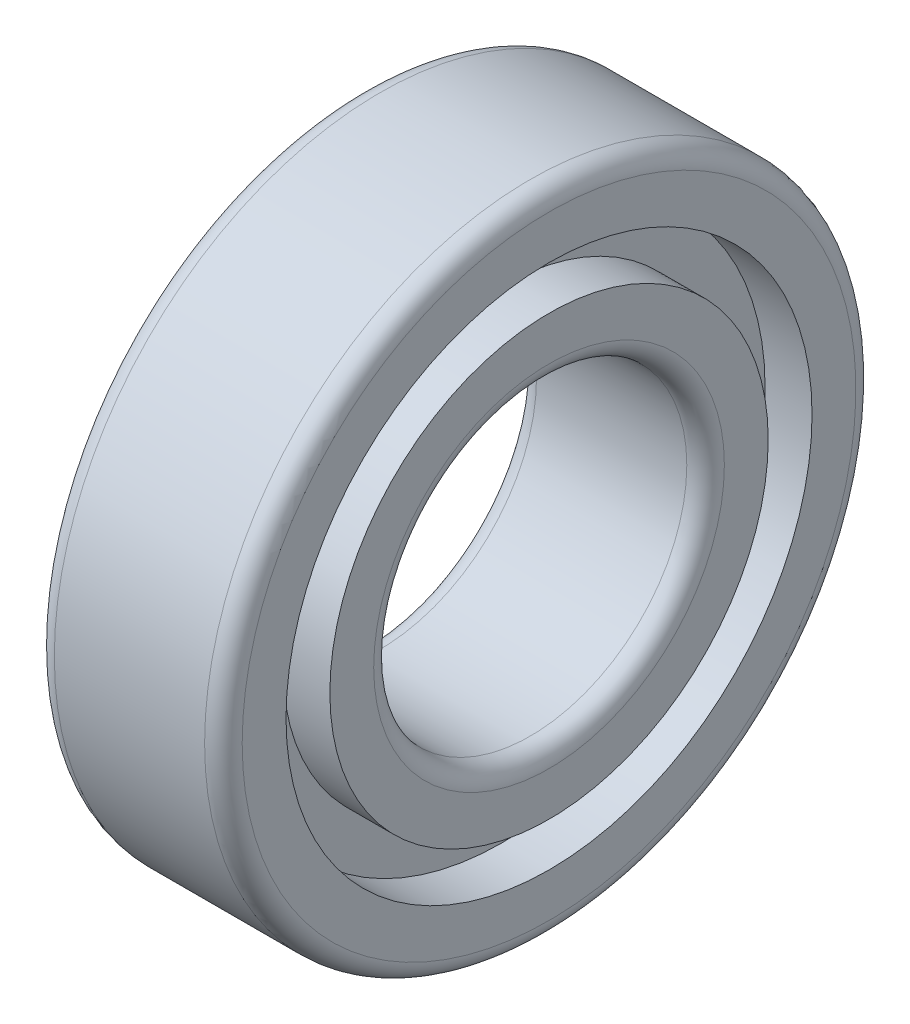
ISO-10303-21;
HEADER;
FILE_DESCRIPTION(('STEP AP214'),'2;1');
FILE_NAME('part.step','',(''),(''),'','','');
FILE_SCHEMA(('AUTOMOTIVE_DESIGN { 1 0 10303 214 1 1 1 1 }'));
ENDSEC;
DATA;
#1=APPLICATION_CONTEXT('core data for automotive mechanical design processes');
#2=APPLICATION_PROTOCOL_DEFINITION('international standard','automotive_design',2000,#1);
#3=PRODUCT_CONTEXT('',#1,'mechanical');
#4=PRODUCT('Part','Part','',(#3));
#5=PRODUCT_RELATED_PRODUCT_CATEGORY('part','',(#4));
#6=PRODUCT_DEFINITION_FORMATION('','',#4);
#7=PRODUCT_DEFINITION_CONTEXT('part definition',#1,'design');
#8=PRODUCT_DEFINITION('design','',#6,#7);
#9=PRODUCT_DEFINITION_SHAPE('','',#8);
#10=(LENGTH_UNIT() NAMED_UNIT(*) SI_UNIT(.MILLI.,.METRE.));
#11=(NAMED_UNIT(*) PLANE_ANGLE_UNIT() SI_UNIT($,.RADIAN.));
#12=(NAMED_UNIT(*) SI_UNIT($,.STERADIAN.) SOLID_ANGLE_UNIT());
#13=UNCERTAINTY_MEASURE_WITH_UNIT(LENGTH_MEASURE(1.E-05),#10,'distance_accuracy_value','');
#14=(GEOMETRIC_REPRESENTATION_CONTEXT(3) GLOBAL_UNCERTAINTY_ASSIGNED_CONTEXT((#13)) GLOBAL_UNIT_ASSIGNED_CONTEXT((#10,
#11,#12)) REPRESENTATION_CONTEXT('',''));
#15=CARTESIAN_POINT('',(0.,0.,0.));
#16=DIRECTION('',(0.,0.,1.));
#17=DIRECTION('',(1.,0.,0.));
#18=AXIS2_PLACEMENT_3D('',#15,#16,#17);
#19=CARTESIAN_POINT('',(-873.991742101089,0.,0.));
#20=DIRECTION('',(-1.,0.,0.));
#21=DIRECTION('',(0.,0.,1.));
#22=AXIS2_PLACEMENT_3D('',#19,#20,#21);
#23=CYLINDRICAL_SURFACE('',#22,17.5);
#24=CARTESIAN_POINT('',(-7.49999999999995,0.,0.));
#25=DIRECTION('',(-1.,0.,0.));
#26=DIRECTION('',(0.,0.,1.));
#27=AXIS2_PLACEMENT_3D('',#24,#25,#26);
#28=CIRCLE('',#27,17.5);
#29=CARTESIAN_POINT('',(-7.49999999999995,0.,17.5));
#30=VERTEX_POINT('',#29);
#31=EDGE_CURVE('E82',#30,#30,#28,.T.);
#32=ORIENTED_EDGE('',*,*,#31,.F.);
#33=EDGE_LOOP('',(#32));
#34=FACE_BOUND('',#33,.T.);
#35=CARTESIAN_POINT('',(-3.75000000000003,0.,0.));
#36=DIRECTION('',(-1.,0.,0.));
#37=DIRECTION('',(0.,0.,1.));
#38=AXIS2_PLACEMENT_3D('',#35,#36,#37);
#39=CIRCLE('',#38,17.5);
#40=CARTESIAN_POINT('',(-3.75000000000003,0.,17.5));
#41=VERTEX_POINT('',#40);
#42=EDGE_CURVE('E10',#41,#41,#39,.T.);
#43=ORIENTED_EDGE('',*,*,#42,.T.);
#44=EDGE_LOOP('',(#43));
#45=FACE_BOUND('',#44,.T.);
#46=ADVANCED_FACE('F30',(#34,#45),#23,.T.);
#47=CARTESIAN_POINT('',(-3.75,17.5,0.));
#48=DIRECTION('',(1.,0.,0.));
#49=DIRECTION('',(0.,0.,-1.));
#50=AXIS2_PLACEMENT_3D('',#47,#48,#49);
#51=PLANE('',#50);
#52=ORIENTED_EDGE('',*,*,#42,.F.);
#53=EDGE_LOOP('',(#52));
#54=FACE_BOUND('',#53,.T.);
#55=CARTESIAN_POINT('',(-3.75000000000003,0.,0.));
#56=DIRECTION('',(-1.,0.,0.));
#57=DIRECTION('',(0.,0.,1.));
#58=AXIS2_PLACEMENT_3D('',#55,#56,#57);
#59=CIRCLE('',#58,21.);
#60=CARTESIAN_POINT('',(-3.75000000000003,0.,21.));
#61=VERTEX_POINT('',#60);
#62=EDGE_CURVE('E36',#61,#61,#59,.T.);
#63=ORIENTED_EDGE('',*,*,#62,.T.);
#64=EDGE_LOOP('',(#63));
#65=FACE_BOUND('',#64,.T.);
#66=ADVANCED_FACE('F89',(#54,#65),#51,.F.);
#67=CARTESIAN_POINT('',(-873.991742101089,0.,0.));
#68=DIRECTION('',(-1.,0.,0.));
#69=DIRECTION('',(0.,0.,1.));
#70=AXIS2_PLACEMENT_3D('',#67,#68,#69);
#71=CYLINDRICAL_SURFACE('',#70,21.);
#72=ORIENTED_EDGE('',*,*,#62,.F.);
#73=EDGE_LOOP('',(#72));
#74=FACE_BOUND('',#73,.T.);
#75=CARTESIAN_POINT('',(-7.49999999999995,0.,0.));
#76=DIRECTION('',(-1.,0.,0.));
#77=DIRECTION('',(0.,0.,1.));
#78=AXIS2_PLACEMENT_3D('',#75,#76,#77);
#79=CIRCLE('',#78,21.);
#80=CARTESIAN_POINT('',(-7.49999999999995,0.,21.));
#81=VERTEX_POINT('',#80);
#82=EDGE_CURVE('E40',#81,#81,#79,.T.);
#83=ORIENTED_EDGE('',*,*,#82,.T.);
#84=EDGE_LOOP('',(#83));
#85=FACE_BOUND('',#84,.T.);
#86=ADVANCED_FACE('F93',(#74,#85),#71,.F.);
#87=CARTESIAN_POINT('',(-7.5,21.,0.));
#88=DIRECTION('',(1.,0.,0.));
#89=DIRECTION('',(0.,0.,-1.));
#90=AXIS2_PLACEMENT_3D('',#87,#88,#89);
#91=PLANE('',#90);
#92=ORIENTED_EDGE('',*,*,#82,.F.);
#93=EDGE_LOOP('',(#92));
#94=FACE_BOUND('',#93,.T.);
#95=CARTESIAN_POINT('',(-7.49999999999995,0.,0.));
#96=DIRECTION('',(-1.,0.,0.));
#97=DIRECTION('',(0.,0.,1.));
#98=AXIS2_PLACEMENT_3D('',#95,#96,#97);
#99=CIRCLE('',#98,24.5);
#100=CARTESIAN_POINT('',(-7.49999999999995,0.,24.5));
#101=VERTEX_POINT('',#100);
#102=EDGE_CURVE('E44',#101,#101,#99,.T.);
#103=ORIENTED_EDGE('',*,*,#102,.T.);
#104=EDGE_LOOP('',(#103));
#105=FACE_BOUND('',#104,.T.);
#106=ADVANCED_FACE('F98',(#94,#105),#91,.F.);
#107=CARTESIAN_POINT('',(-6.,0.,0.));
#108=DIRECTION('',(-1.,0.,0.));
#109=DIRECTION('',(0.,0.,1.));
#110=AXIS2_PLACEMENT_3D('',#107,#108,#109);
#111=TOROIDAL_SURFACE('',#110,24.5,1.5);
#112=ORIENTED_EDGE('',*,*,#102,.F.);
#113=EDGE_LOOP('',(#112));
#114=FACE_BOUND('',#113,.T.);
#115=CARTESIAN_POINT('',(-6.00000000000001,0.,0.));
#116=DIRECTION('',(-1.,0.,0.));
#117=DIRECTION('',(0.,0.,1.));
#118=AXIS2_PLACEMENT_3D('',#115,#116,#117);
#119=CIRCLE('',#118,26.);
#120=CARTESIAN_POINT('',(-6.00000000000001,0.,26.));
#121=VERTEX_POINT('',#120);
#122=EDGE_CURVE('E49',#121,#121,#119,.T.);
#123=ORIENTED_EDGE('',*,*,#122,.T.);
#124=EDGE_LOOP('',(#123));
#125=FACE_BOUND('',#124,.T.);
#126=ADVANCED_FACE('F104',(#114,#125),#111,.T.);
#127=CARTESIAN_POINT('',(-873.991742101089,0.,0.));
#128=DIRECTION('',(-1.,0.,0.));
#129=DIRECTION('',(0.,0.,1.));
#130=AXIS2_PLACEMENT_3D('',#127,#128,#129);
#131=CYLINDRICAL_SURFACE('',#130,26.);
#132=ORIENTED_EDGE('',*,*,#122,.F.);
#133=EDGE_LOOP('',(#132));
#134=FACE_BOUND('',#133,.T.);
#135=CARTESIAN_POINT('',(6.00000000000001,0.,0.));
#136=DIRECTION('',(-1.,0.,0.));
#137=DIRECTION('',(0.,0.,1.));
#138=AXIS2_PLACEMENT_3D('',#135,#136,#137);
#139=CIRCLE('',#138,26.);
#140=CARTESIAN_POINT('',(6.00000000000001,0.,26.));
#141=VERTEX_POINT('',#140);
#142=EDGE_CURVE('E52',#141,#141,#139,.T.);
#143=ORIENTED_EDGE('',*,*,#142,.T.);
#144=EDGE_LOOP('',(#143));
#145=FACE_BOUND('',#144,.T.);
#146=ADVANCED_FACE('F108',(#134,#145),#131,.T.);
#147=CARTESIAN_POINT('',(6.,0.,0.));
#148=DIRECTION('',(-1.,0.,0.));
#149=DIRECTION('',(0.,0.,1.));
#150=AXIS2_PLACEMENT_3D('',#147,#148,#149);
#151=TOROIDAL_SURFACE('',#150,24.5,1.5);
#152=ORIENTED_EDGE('',*,*,#142,.F.);
#153=EDGE_LOOP('',(#152));
#154=FACE_BOUND('',#153,.T.);
#155=CARTESIAN_POINT('',(7.49999999999995,0.,0.));
#156=DIRECTION('',(-1.,0.,0.));
#157=DIRECTION('',(0.,0.,1.));
#158=AXIS2_PLACEMENT_3D('',#155,#156,#157);
#159=CIRCLE('',#158,24.5);
#160=CARTESIAN_POINT('',(7.49999999999995,0.,24.5));
#161=VERTEX_POINT('',#160);
#162=EDGE_CURVE('E55',#161,#161,#159,.T.);
#163=ORIENTED_EDGE('',*,*,#162,.T.);
#164=EDGE_LOOP('',(#163));
#165=FACE_BOUND('',#164,.T.);
#166=ADVANCED_FACE('F112',(#154,#165),#151,.T.);
#167=CARTESIAN_POINT('',(7.5,21.,0.));
#168=DIRECTION('',(-1.,0.,0.));
#169=DIRECTION('',(0.,0.,1.));
#170=AXIS2_PLACEMENT_3D('',#167,#168,#169);
#171=PLANE('',#170);
#172=ORIENTED_EDGE('',*,*,#162,.F.);
#173=EDGE_LOOP('',(#172));
#174=FACE_BOUND('',#173,.T.);
#175=CARTESIAN_POINT('',(7.49999999999995,0.,0.));
#176=DIRECTION('',(-1.,0.,0.));
#177=DIRECTION('',(0.,0.,1.));
#178=AXIS2_PLACEMENT_3D('',#175,#176,#177);
#179=CIRCLE('',#178,21.);
#180=CARTESIAN_POINT('',(7.49999999999995,0.,21.));
#181=VERTEX_POINT('',#180);
#182=EDGE_CURVE('E58',#181,#181,#179,.T.);
#183=ORIENTED_EDGE('',*,*,#182,.T.);
#184=EDGE_LOOP('',(#183));
#185=FACE_BOUND('',#184,.T.);
#186=ADVANCED_FACE('F116',(#174,#185),#171,.F.);
#187=CARTESIAN_POINT('',(-873.991742101089,0.,0.));
#188=DIRECTION('',(-1.,0.,0.));
#189=DIRECTION('',(0.,0.,1.));
#190=AXIS2_PLACEMENT_3D('',#187,#188,#189);
#191=CYLINDRICAL_SURFACE('',#190,21.);
#192=ORIENTED_EDGE('',*,*,#182,.F.);
#193=EDGE_LOOP('',(#192));
#194=FACE_BOUND('',#193,.T.);
#195=CARTESIAN_POINT('',(3.75000000000003,0.,0.));
#196=DIRECTION('',(-1.,0.,0.));
#197=DIRECTION('',(0.,0.,1.));
#198=AXIS2_PLACEMENT_3D('',#195,#196,#197);
#199=CIRCLE('',#198,21.);
#200=CARTESIAN_POINT('',(3.75000000000003,0.,21.));
#201=VERTEX_POINT('',#200);
#202=EDGE_CURVE('E61',#201,#201,#199,.T.);
#203=ORIENTED_EDGE('',*,*,#202,.T.);
#204=EDGE_LOOP('',(#203));
#205=FACE_BOUND('',#204,.T.);
#206=ADVANCED_FACE('F120',(#194,#205),#191,.F.);
#207=CARTESIAN_POINT('',(3.75,17.5,0.));
#208=DIRECTION('',(-1.,0.,0.));
#209=DIRECTION('',(0.,0.,1.));
#210=AXIS2_PLACEMENT_3D('',#207,#208,#209);
#211=PLANE('',#210);
#212=ORIENTED_EDGE('',*,*,#202,.F.);
#213=EDGE_LOOP('',(#212));
#214=FACE_BOUND('',#213,.T.);
#215=CARTESIAN_POINT('',(3.75000000000003,0.,0.));
#216=DIRECTION('',(-1.,0.,0.));
#217=DIRECTION('',(0.,0.,1.));
#218=AXIS2_PLACEMENT_3D('',#215,#216,#217);
#219=CIRCLE('',#218,17.5);
#220=CARTESIAN_POINT('',(3.75000000000003,0.,17.5));
#221=VERTEX_POINT('',#220);
#222=EDGE_CURVE('E64',#221,#221,#219,.T.);
#223=ORIENTED_EDGE('',*,*,#222,.T.);
#224=EDGE_LOOP('',(#223));
#225=FACE_BOUND('',#224,.T.);
#226=ADVANCED_FACE('F124',(#214,#225),#211,.F.);
#227=CARTESIAN_POINT('',(-873.991742101089,0.,0.));
#228=DIRECTION('',(-1.,0.,0.));
#229=DIRECTION('',(0.,0.,1.));
#230=AXIS2_PLACEMENT_3D('',#227,#228,#229);
#231=CYLINDRICAL_SURFACE('',#230,17.5);
#232=ORIENTED_EDGE('',*,*,#222,.F.);
#233=EDGE_LOOP('',(#232));
#234=FACE_BOUND('',#233,.T.);
#235=CARTESIAN_POINT('',(7.49999999999995,0.,0.));
#236=DIRECTION('',(-1.,0.,0.));
#237=DIRECTION('',(0.,0.,1.));
#238=AXIS2_PLACEMENT_3D('',#235,#236,#237);
#239=CIRCLE('',#238,17.5);
#240=CARTESIAN_POINT('',(7.49999999999995,0.,17.5));
#241=VERTEX_POINT('',#240);
#242=EDGE_CURVE('E67',#241,#241,#239,.T.);
#243=ORIENTED_EDGE('',*,*,#242,.T.);
#244=EDGE_LOOP('',(#243));
#245=FACE_BOUND('',#244,.T.);
#246=ADVANCED_FACE('F128',(#234,#245),#231,.T.);
#247=CARTESIAN_POINT('',(7.5,14.,0.));
#248=DIRECTION('',(-1.,0.,0.));
#249=DIRECTION('',(0.,0.,1.));
#250=AXIS2_PLACEMENT_3D('',#247,#248,#249);
#251=PLANE('',#250);
#252=ORIENTED_EDGE('',*,*,#242,.F.);
#253=EDGE_LOOP('',(#252));
#254=FACE_BOUND('',#253,.T.);
#255=CARTESIAN_POINT('',(7.49999999999995,0.,0.));
#256=DIRECTION('',(-1.,0.,0.));
#257=DIRECTION('',(0.,0.,1.));
#258=AXIS2_PLACEMENT_3D('',#255,#256,#257);
#259=CIRCLE('',#258,14.);
#260=CARTESIAN_POINT('',(7.49999999999995,0.,14.));
#261=VERTEX_POINT('',#260);
#262=EDGE_CURVE('E70',#261,#261,#259,.T.);
#263=ORIENTED_EDGE('',*,*,#262,.T.);
#264=EDGE_LOOP('',(#263));
#265=FACE_BOUND('',#264,.T.);
#266=ADVANCED_FACE('F132',(#254,#265),#251,.F.);
#267=CARTESIAN_POINT('',(6.,0.,0.));
#268=DIRECTION('',(-1.,0.,0.));
#269=DIRECTION('',(0.,0.,1.));
#270=AXIS2_PLACEMENT_3D('',#267,#268,#269);
#271=TOROIDAL_SURFACE('',#270,14.,1.5);
#272=ORIENTED_EDGE('',*,*,#262,.F.);
#273=EDGE_LOOP('',(#272));
#274=FACE_BOUND('',#273,.T.);
#275=CARTESIAN_POINT('',(6.00000000000001,0.,0.));
#276=DIRECTION('',(-1.,0.,0.));
#277=DIRECTION('',(0.,0.,1.));
#278=AXIS2_PLACEMENT_3D('',#275,#276,#277);
#279=CIRCLE('',#278,12.5);
#280=CARTESIAN_POINT('',(6.00000000000001,0.,12.5));
#281=VERTEX_POINT('',#280);
#282=EDGE_CURVE('E73',#281,#281,#279,.T.);
#283=ORIENTED_EDGE('',*,*,#282,.T.);
#284=EDGE_LOOP('',(#283));
#285=FACE_BOUND('',#284,.T.);
#286=ADVANCED_FACE('F136',(#274,#285),#271,.T.);
#287=CARTESIAN_POINT('',(-873.991742101089,0.,0.));
#288=DIRECTION('',(-1.,0.,0.));
#289=DIRECTION('',(0.,0.,1.));
#290=AXIS2_PLACEMENT_3D('',#287,#288,#289);
#291=CYLINDRICAL_SURFACE('',#290,12.5);
#292=ORIENTED_EDGE('',*,*,#282,.F.);
#293=EDGE_LOOP('',(#292));
#294=FACE_BOUND('',#293,.T.);
#295=CARTESIAN_POINT('',(-6.00000000000001,0.,0.));
#296=DIRECTION('',(-1.,0.,0.));
#297=DIRECTION('',(0.,0.,1.));
#298=AXIS2_PLACEMENT_3D('',#295,#296,#297);
#299=CIRCLE('',#298,12.5);
#300=CARTESIAN_POINT('',(-6.00000000000001,0.,12.5));
#301=VERTEX_POINT('',#300);
#302=EDGE_CURVE('E76',#301,#301,#299,.T.);
#303=ORIENTED_EDGE('',*,*,#302,.T.);
#304=EDGE_LOOP('',(#303));
#305=FACE_BOUND('',#304,.T.);
#306=ADVANCED_FACE('F140',(#294,#305),#291,.F.);
#307=CARTESIAN_POINT('',(-6.,0.,0.));
#308=DIRECTION('',(-1.,0.,0.));
#309=DIRECTION('',(0.,0.,1.));
#310=AXIS2_PLACEMENT_3D('',#307,#308,#309);
#311=TOROIDAL_SURFACE('',#310,14.,1.5);
#312=ORIENTED_EDGE('',*,*,#302,.F.);
#313=EDGE_LOOP('',(#312));
#314=FACE_BOUND('',#313,.T.);
#315=CARTESIAN_POINT('',(-7.49999999999995,0.,0.));
#316=DIRECTION('',(-1.,0.,0.));
#317=DIRECTION('',(0.,0.,1.));
#318=AXIS2_PLACEMENT_3D('',#315,#316,#317);
#319=CIRCLE('',#318,14.);
#320=CARTESIAN_POINT('',(-7.49999999999995,0.,14.));
#321=VERTEX_POINT('',#320);
#322=EDGE_CURVE('E79',#321,#321,#319,.T.);
#323=ORIENTED_EDGE('',*,*,#322,.T.);
#324=EDGE_LOOP('',(#323));
#325=FACE_BOUND('',#324,.T.);
#326=ADVANCED_FACE('F144',(#314,#325),#311,.T.);
#327=CARTESIAN_POINT('',(-7.5,14.,0.));
#328=DIRECTION('',(1.,0.,0.));
#329=DIRECTION('',(0.,0.,-1.));
#330=AXIS2_PLACEMENT_3D('',#327,#328,#329);
#331=PLANE('',#330);
#332=ORIENTED_EDGE('',*,*,#322,.F.);
#333=EDGE_LOOP('',(#332));
#334=FACE_BOUND('',#333,.T.);
#335=ORIENTED_EDGE('',*,*,#31,.T.);
#336=EDGE_LOOP('',(#335));
#337=FACE_BOUND('',#336,.T.);
#338=ADVANCED_FACE('F86',(#334,#337),#331,.F.);
#339=CLOSED_SHELL('',(#46,#66,#86,#106,#126,#146,#166,#186,#206,#226,#246,#266,#286,#306,#326,#338));
#340=MANIFOLD_SOLID_BREP('B2',#339);
#341=ADVANCED_BREP_SHAPE_REPRESENTATION('',(#18,#340),#14);
#342=SHAPE_DEFINITION_REPRESENTATION(#9,#341);
ENDSEC;
END-ISO-10303-21;
